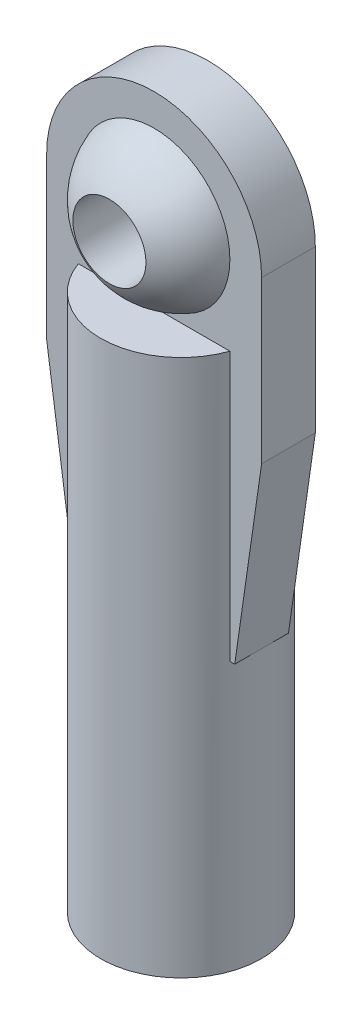
ISO-10303-21;
HEADER;
FILE_DESCRIPTION(('STEP AP214'),'2;1');
FILE_NAME('part.step','',(''),(''),'','','');
FILE_SCHEMA(('AUTOMOTIVE_DESIGN { 1 0 10303 214 1 1 1 1 }'));
ENDSEC;
DATA;
#1=APPLICATION_CONTEXT('core data for automotive mechanical design processes');
#2=APPLICATION_PROTOCOL_DEFINITION('international standard','automotive_design',2000,#1);
#3=PRODUCT_CONTEXT('',#1,'mechanical');
#4=PRODUCT('Part','Part','',(#3));
#5=PRODUCT_RELATED_PRODUCT_CATEGORY('part','',(#4));
#6=PRODUCT_DEFINITION_FORMATION('','',#4);
#7=PRODUCT_DEFINITION_CONTEXT('part definition',#1,'design');
#8=PRODUCT_DEFINITION('design','',#6,#7);
#9=PRODUCT_DEFINITION_SHAPE('','',#8);
#10=(LENGTH_UNIT() NAMED_UNIT(*) SI_UNIT(.MILLI.,.METRE.));
#11=(NAMED_UNIT(*) PLANE_ANGLE_UNIT() SI_UNIT($,.RADIAN.));
#12=(NAMED_UNIT(*) SI_UNIT($,.STERADIAN.) SOLID_ANGLE_UNIT());
#13=UNCERTAINTY_MEASURE_WITH_UNIT(LENGTH_MEASURE(1.E-05),#10,'distance_accuracy_value','');
#14=(GEOMETRIC_REPRESENTATION_CONTEXT(3) GLOBAL_UNCERTAINTY_ASSIGNED_CONTEXT((#13)) GLOBAL_UNIT_ASSIGNED_CONTEXT((#10,
#11,#12)) REPRESENTATION_CONTEXT('',''));
#15=CARTESIAN_POINT('',(0.,0.,0.));
#16=DIRECTION('',(0.,0.,1.));
#17=DIRECTION('',(1.,0.,0.));
#18=AXIS2_PLACEMENT_3D('',#15,#16,#17);
#19=CARTESIAN_POINT('',(-2.38125,-10.287,0.79375));
#20=DIRECTION('',(0.,1.,0.));
#21=DIRECTION('',(0.,0.,1.));
#22=AXIS2_PLACEMENT_3D('',#19,#20,#21);
#23=PLANE('',#22);
#24=DIRECTION('',(1.,0.,0.));
#25=VECTOR('',#24,1.);
#26=CARTESIAN_POINT('',(-2.38125,-10.287,0.79375));
#27=LINE('',#26,#25);
#28=CARTESIAN_POINT('',(2.23832771226646,-10.287,0.79375));
#29=VERTEX_POINT('',#28);
#30=CARTESIAN_POINT('',(2.38125,-10.287,0.79375));
#31=VERTEX_POINT('',#30);
#32=EDGE_CURVE('E92',#29,#31,#27,.T.);
#33=ORIENTED_EDGE('',*,*,#32,.F.);
#34=CARTESIAN_POINT('',(0.,-10.287,0.));
#35=DIRECTION('',(0.,1.,0.));
#36=DIRECTION('',(0.,0.,1.));
#37=AXIS2_PLACEMENT_3D('',#34,#35,#36);
#38=CIRCLE('',#37,2.3749);
#39=CARTESIAN_POINT('',(2.23832771226646,-10.287,-0.79375));
#40=VERTEX_POINT('',#39);
#41=EDGE_CURVE('E41',#29,#40,#38,.T.);
#42=ORIENTED_EDGE('',*,*,#41,.T.);
#43=DIRECTION('',(1.,0.,0.));
#44=VECTOR('',#43,1.);
#45=CARTESIAN_POINT('',(-2.38125,-10.287,-0.79375));
#46=LINE('',#45,#44);
#47=CARTESIAN_POINT('',(2.38125,-10.287,-0.79375));
#48=VERTEX_POINT('',#47);
#49=EDGE_CURVE('E135',#40,#48,#46,.T.);
#50=ORIENTED_EDGE('',*,*,#49,.T.);
#51=DIRECTION('',(0.,0.,-1.));
#52=VECTOR('',#51,1.);
#53=CARTESIAN_POINT('',(2.38125,-10.287,0.79375));
#54=LINE('',#53,#52);
#55=EDGE_CURVE('E149',#31,#48,#54,.T.);
#56=ORIENTED_EDGE('',*,*,#55,.F.);
#57=EDGE_LOOP('',(#33,#42,#50,#56));
#58=FACE_BOUND('',#57,.T.);
#59=ADVANCED_FACE('F33',(#58),#23,.F.);
#60=CARTESIAN_POINT('',(0.,0.,0.));
#61=DIRECTION('',(0.,1.,0.));
#62=DIRECTION('',(1.,0.,0.));
#63=AXIS2_PLACEMENT_3D('',#60,#61,#62);
#64=SPHERICAL_SURFACE('',#63,2.3749);
#65=CARTESIAN_POINT('',(0.,0.,0.));
#66=DIRECTION('',(0.,0.,1.));
#67=DIRECTION('',(1.,0.,0.));
#68=AXIS2_PLACEMENT_3D('',#65,#66,#67);
#69=SPHERICAL_SURFACE('',#68,2.3749);
#70=CARTESIAN_POINT('',(0.,0.,-2.11537934186755));
#71=DIRECTION('',(0.,0.,1.));
#72=DIRECTION('',(1.,0.,0.));
#73=AXIS2_PLACEMENT_3D('',#70,#71,#72);
#74=CIRCLE('',#73,1.0795);
#75=CARTESIAN_POINT('',(1.0795,0.,-2.11537934186755));
#76=VERTEX_POINT('',#75);
#77=EDGE_CURVE('E160',#76,#76,#74,.T.);
#78=ORIENTED_EDGE('',*,*,#77,.T.);
#79=EDGE_LOOP('',(#78));
#80=FACE_BOUND('',#79,.T.);
#81=CARTESIAN_POINT('',(0.,0.,-0.79375));
#82=DIRECTION('',(0.,0.,1.));
#83=DIRECTION('',(1.,0.,0.));
#84=AXIS2_PLACEMENT_3D('',#81,#82,#83);
#85=CIRCLE('',#84,2.23832771226646);
#86=CARTESIAN_POINT('',(2.23832771226646,0.,-0.79375));
#87=VERTEX_POINT('',#86);
#88=EDGE_CURVE('E153',#87,#87,#85,.T.);
#89=ORIENTED_EDGE('',*,*,#88,.F.);
#90=EDGE_LOOP('',(#89));
#91=FACE_BOUND('',#90,.T.);
#92=ADVANCED_FACE('F248',(#80,#91),#69,.T.);
#93=CARTESIAN_POINT('',(0.,0.,0.));
#94=DIRECTION('',(0.,0.,1.));
#95=DIRECTION('',(1.,0.,0.));
#96=AXIS2_PLACEMENT_3D('',#93,#94,#95);
#97=SPHERICAL_SURFACE('',#96,2.3749);
#98=CARTESIAN_POINT('',(0.,0.,0.79375));
#99=DIRECTION('',(0.,0.,1.));
#100=DIRECTION('',(1.,0.,0.));
#101=AXIS2_PLACEMENT_3D('',#98,#99,#100);
#102=CIRCLE('',#101,2.23832771226646);
#103=CARTESIAN_POINT('',(2.23832771226646,0.,0.79375));
#104=VERTEX_POINT('',#103);
#105=EDGE_CURVE('E152',#104,#104,#102,.T.);
#106=ORIENTED_EDGE('',*,*,#105,.T.);
#107=EDGE_LOOP('',(#106));
#108=FACE_BOUND('',#107,.T.);
#109=CARTESIAN_POINT('',(0.,0.,2.11537934186755));
#110=DIRECTION('',(0.,0.,-1.));
#111=DIRECTION('',(-1.,0.,0.));
#112=AXIS2_PLACEMENT_3D('',#109,#110,#111);
#113=CIRCLE('',#112,1.0795);
#114=CARTESIAN_POINT('',(-1.0795,0.,2.11537934186755));
#115=VERTEX_POINT('',#114);
#116=EDGE_CURVE('E157',#115,#115,#113,.T.);
#117=ORIENTED_EDGE('',*,*,#116,.T.);
#118=EDGE_LOOP('',(#117));
#119=FACE_BOUND('',#118,.T.);
#120=ADVANCED_FACE('F35',(#108,#119),#97,.T.);
#121=CARTESIAN_POINT('',(0.,0.,-2.3749));
#122=DIRECTION('',(0.,0.,1.));
#123=DIRECTION('',(1.,0.,0.));
#124=AXIS2_PLACEMENT_3D('',#121,#122,#123);
#125=CYLINDRICAL_SURFACE('',#124,1.0795);
#126=ORIENTED_EDGE('',*,*,#116,.F.);
#127=EDGE_LOOP('',(#126));
#128=FACE_BOUND('',#127,.T.);
#129=ORIENTED_EDGE('',*,*,#77,.F.);
#130=EDGE_LOOP('',(#129));
#131=FACE_BOUND('',#130,.T.);
#132=ADVANCED_FACE('F264',(#128,#131),#125,.F.);
#133=CARTESIAN_POINT('',(0.,0.,0.79375));
#134=DIRECTION('',(0.,0.,1.));
#135=DIRECTION('',(1.,0.,0.));
#136=AXIS2_PLACEMENT_3D('',#133,#134,#135);
#137=PLANE('',#136);
#138=DIRECTION('',(0.,-1.,0.));
#139=VECTOR('',#138,1.);
#140=CARTESIAN_POINT('',(-2.23832771226646,-2.3495,0.79375));
#141=LINE('',#140,#139);
#142=CARTESIAN_POINT('',(-2.23832771226646,-2.3495,0.79375));
#143=VERTEX_POINT('',#142);
#144=CARTESIAN_POINT('',(-2.23832771226646,-10.287,0.79375));
#145=VERTEX_POINT('',#144);
#146=EDGE_CURVE('E48',#143,#145,#141,.T.);
#147=ORIENTED_EDGE('',*,*,#146,.F.);
#148=DIRECTION('',(1.,0.,0.));
#149=VECTOR('',#148,1.);
#150=CARTESIAN_POINT('',(0.,-2.3495,0.79375));
#151=LINE('',#150,#149);
#152=CARTESIAN_POINT('',(2.23832771226646,-2.3495,0.79375));
#153=VERTEX_POINT('',#152);
#154=EDGE_CURVE('E183',#143,#153,#151,.T.);
#155=ORIENTED_EDGE('',*,*,#154,.T.);
#156=DIRECTION('',(0.,-1.,0.));
#157=VECTOR('',#156,1.);
#158=CARTESIAN_POINT('',(2.23832771226646,-2.3495,0.79375));
#159=LINE('',#158,#157);
#160=EDGE_CURVE('E185',#29,#153,#159,.F.);
#161=ORIENTED_EDGE('',*,*,#160,.F.);
#162=ORIENTED_EDGE('',*,*,#32,.T.);
#163=DIRECTION('',(0.142217729757998,0.989835399115672,0.));
#164=VECTOR('',#163,1.);
#165=CARTESIAN_POINT('',(3.175,-4.7625,0.79375));
#166=LINE('',#165,#164);
#167=CARTESIAN_POINT('',(3.175,-4.7625,0.79375));
#168=VERTEX_POINT('',#167);
#169=EDGE_CURVE('E194',#31,#168,#166,.T.);
#170=ORIENTED_EDGE('',*,*,#169,.T.);
#171=DIRECTION('',(0.,1.,0.));
#172=VECTOR('',#171,1.);
#173=CARTESIAN_POINT('',(3.175,0.,0.79375));
#174=LINE('',#173,#172);
#175=CARTESIAN_POINT('',(3.175,0.,0.79375));
#176=VERTEX_POINT('',#175);
#177=EDGE_CURVE('E110',#168,#176,#174,.T.);
#178=ORIENTED_EDGE('',*,*,#177,.T.);
#179=CARTESIAN_POINT('',(0.,0.,0.79375));
#180=DIRECTION('',(0.,0.,1.));
#181=DIRECTION('',(1.,0.,0.));
#182=AXIS2_PLACEMENT_3D('',#179,#180,#181);
#183=CIRCLE('',#182,3.175);
#184=CARTESIAN_POINT('',(-3.175,0.,0.79375));
#185=VERTEX_POINT('',#184);
#186=EDGE_CURVE('E102',#176,#185,#183,.T.);
#187=ORIENTED_EDGE('',*,*,#186,.T.);
#188=DIRECTION('',(0.,-1.,0.));
#189=VECTOR('',#188,1.);
#190=CARTESIAN_POINT('',(-3.175,0.,0.79375));
#191=LINE('',#190,#189);
#192=CARTESIAN_POINT('',(-3.175,-4.7625,0.79375));
#193=VERTEX_POINT('',#192);
#194=EDGE_CURVE('E107',#185,#193,#191,.T.);
#195=ORIENTED_EDGE('',*,*,#194,.T.);
#196=DIRECTION('',(0.142217729757999,-0.989835399115672,0.));
#197=VECTOR('',#196,1.);
#198=CARTESIAN_POINT('',(-3.175,-4.7625,0.79375));
#199=LINE('',#198,#197);
#200=CARTESIAN_POINT('',(-2.38125,-10.287,0.79375));
#201=VERTEX_POINT('',#200);
#202=EDGE_CURVE('E57',#193,#201,#199,.T.);
#203=ORIENTED_EDGE('',*,*,#202,.T.);
#204=EDGE_CURVE('E192',#201,#145,#27,.T.);
#205=ORIENTED_EDGE('',*,*,#204,.T.);
#206=EDGE_LOOP('',(#147,#155,#161,#162,#170,#178,#187,#195,#203,#205));
#207=FACE_BOUND('',#206,.T.);
#208=ORIENTED_EDGE('',*,*,#105,.F.);
#209=EDGE_LOOP('',(#208));
#210=FACE_BOUND('',#209,.T.);
#211=ADVANCED_FACE('F104',(#207,#210),#137,.T.);
#212=CARTESIAN_POINT('',(0.,0.,-0.79375));
#213=DIRECTION('',(0.,0.,1.));
#214=DIRECTION('',(1.,0.,0.));
#215=AXIS2_PLACEMENT_3D('',#212,#213,#214);
#216=PLANE('',#215);
#217=DIRECTION('',(1.,0.,0.));
#218=VECTOR('',#217,1.);
#219=CARTESIAN_POINT('',(0.,-2.3495,-0.79375));
#220=LINE('',#219,#218);
#221=CARTESIAN_POINT('',(-2.23832771226646,-2.3495,-0.79375));
#222=VERTEX_POINT('',#221);
#223=CARTESIAN_POINT('',(2.23832771226646,-2.3495,-0.79375));
#224=VERTEX_POINT('',#223);
#225=EDGE_CURVE('E11',#222,#224,#220,.T.);
#226=ORIENTED_EDGE('',*,*,#225,.F.);
#227=DIRECTION('',(0.,-1.,0.));
#228=VECTOR('',#227,1.);
#229=CARTESIAN_POINT('',(-2.23832771226646,-2.3495,-0.79375));
#230=LINE('',#229,#228);
#231=CARTESIAN_POINT('',(-2.23832771226646,-10.287,-0.79375));
#232=VERTEX_POINT('',#231);
#233=EDGE_CURVE('E206',#222,#232,#230,.T.);
#234=ORIENTED_EDGE('',*,*,#233,.T.);
#235=CARTESIAN_POINT('',(-2.38125,-10.287,-0.79375));
#236=VERTEX_POINT('',#235);
#237=EDGE_CURVE('E131',#236,#232,#46,.T.);
#238=ORIENTED_EDGE('',*,*,#237,.F.);
#239=DIRECTION('',(0.142217729757999,-0.989835399115672,0.));
#240=VECTOR('',#239,1.);
#241=CARTESIAN_POINT('',(-3.175,-4.7625,-0.79375));
#242=LINE('',#241,#240);
#243=CARTESIAN_POINT('',(-3.175,-4.7625,-0.79375));
#244=VERTEX_POINT('',#243);
#245=EDGE_CURVE('E84',#244,#236,#242,.T.);
#246=ORIENTED_EDGE('',*,*,#245,.F.);
#247=DIRECTION('',(0.,-1.,0.));
#248=VECTOR('',#247,1.);
#249=CARTESIAN_POINT('',(-3.175,0.,-0.79375));
#250=LINE('',#249,#248);
#251=CARTESIAN_POINT('',(-3.175,0.,-0.79375));
#252=VERTEX_POINT('',#251);
#253=EDGE_CURVE('E140',#252,#244,#250,.T.);
#254=ORIENTED_EDGE('',*,*,#253,.F.);
#255=CARTESIAN_POINT('',(0.,0.,-0.79375));
#256=DIRECTION('',(0.,0.,1.));
#257=DIRECTION('',(1.,0.,0.));
#258=AXIS2_PLACEMENT_3D('',#255,#256,#257);
#259=CIRCLE('',#258,3.175);
#260=CARTESIAN_POINT('',(3.175,0.,-0.79375));
#261=VERTEX_POINT('',#260);
#262=EDGE_CURVE('E119',#261,#252,#259,.T.);
#263=ORIENTED_EDGE('',*,*,#262,.F.);
#264=DIRECTION('',(0.,1.,0.));
#265=VECTOR('',#264,1.);
#266=CARTESIAN_POINT('',(3.175,0.,-0.79375));
#267=LINE('',#266,#265);
#268=CARTESIAN_POINT('',(3.175,-4.7625,-0.79375));
#269=VERTEX_POINT('',#268);
#270=EDGE_CURVE('E137',#269,#261,#267,.T.);
#271=ORIENTED_EDGE('',*,*,#270,.F.);
#272=DIRECTION('',(0.142217729757998,0.989835399115672,0.));
#273=VECTOR('',#272,1.);
#274=CARTESIAN_POINT('',(3.175,-4.7625,-0.79375));
#275=LINE('',#274,#273);
#276=EDGE_CURVE('E134',#48,#269,#275,.T.);
#277=ORIENTED_EDGE('',*,*,#276,.F.);
#278=ORIENTED_EDGE('',*,*,#49,.F.);
#279=DIRECTION('',(0.,-1.,0.));
#280=VECTOR('',#279,1.);
#281=CARTESIAN_POINT('',(2.23832771226646,-2.3495,-0.79375));
#282=LINE('',#281,#280);
#283=EDGE_CURVE('E181',#40,#224,#282,.F.);
#284=ORIENTED_EDGE('',*,*,#283,.T.);
#285=EDGE_LOOP('',(#226,#234,#238,#246,#254,#263,#271,#277,#278,#284));
#286=FACE_BOUND('',#285,.T.);
#287=ORIENTED_EDGE('',*,*,#88,.T.);
#288=EDGE_LOOP('',(#287));
#289=FACE_BOUND('',#288,.T.);
#290=ADVANCED_FACE('F178',(#286,#289),#216,.F.);
#291=ORIENTED_EDGE('',*,*,#237,.T.);
#292=EDGE_CURVE('E156',#232,#145,#38,.T.);
#293=ORIENTED_EDGE('',*,*,#292,.T.);
#294=ORIENTED_EDGE('',*,*,#204,.F.);
#295=DIRECTION('',(0.,0.,-1.));
#296=VECTOR('',#295,1.);
#297=CARTESIAN_POINT('',(-2.38125,-10.287,0.79375));
#298=LINE('',#297,#296);
#299=EDGE_CURVE('E127',#201,#236,#298,.T.);
#300=ORIENTED_EDGE('',*,*,#299,.T.);
#301=EDGE_LOOP('',(#291,#293,#294,#300));
#302=FACE_BOUND('',#301,.T.);
#303=ADVANCED_FACE('F202',(#302),#23,.F.);
#304=CARTESIAN_POINT('',(3.175,-4.7625,0.79375));
#305=DIRECTION('',(-0.989835399115672,0.142217729757998,0.));
#306=DIRECTION('',(-0.142217729757998,-0.989835399115672,0.));
#307=AXIS2_PLACEMENT_3D('',#304,#305,#306);
#308=PLANE('',#307);
#309=ORIENTED_EDGE('',*,*,#276,.T.);
#310=DIRECTION('',(0.,0.,-1.));
#311=VECTOR('',#310,1.);
#312=CARTESIAN_POINT('',(3.175,-4.7625,0.79375));
#313=LINE('',#312,#311);
#314=EDGE_CURVE('E146',#168,#269,#313,.T.);
#315=ORIENTED_EDGE('',*,*,#314,.F.);
#316=ORIENTED_EDGE('',*,*,#169,.F.);
#317=ORIENTED_EDGE('',*,*,#55,.T.);
#318=EDGE_LOOP('',(#309,#315,#316,#317));
#319=FACE_BOUND('',#318,.T.);
#320=ADVANCED_FACE('F197',(#319),#308,.F.);
#321=CARTESIAN_POINT('',(3.175,0.,0.79375));
#322=DIRECTION('',(-1.,0.,0.));
#323=DIRECTION('',(0.,-1.,0.));
#324=AXIS2_PLACEMENT_3D('',#321,#322,#323);
#325=PLANE('',#324);
#326=ORIENTED_EDGE('',*,*,#270,.T.);
#327=DIRECTION('',(0.,0.,-1.));
#328=VECTOR('',#327,1.);
#329=CARTESIAN_POINT('',(3.175,0.,0.79375));
#330=LINE('',#329,#328);
#331=EDGE_CURVE('E122',#176,#261,#330,.T.);
#332=ORIENTED_EDGE('',*,*,#331,.F.);
#333=ORIENTED_EDGE('',*,*,#177,.F.);
#334=ORIENTED_EDGE('',*,*,#314,.T.);
#335=EDGE_LOOP('',(#326,#332,#333,#334));
#336=FACE_BOUND('',#335,.T.);
#337=ADVANCED_FACE('F199',(#336),#325,.F.);
#338=CARTESIAN_POINT('',(0.,0.,0.79375));
#339=DIRECTION('',(0.,0.,-1.));
#340=DIRECTION('',(-1.,0.,0.));
#341=AXIS2_PLACEMENT_3D('',#338,#339,#340);
#342=CYLINDRICAL_SURFACE('',#341,3.175);
#343=ORIENTED_EDGE('',*,*,#262,.T.);
#344=DIRECTION('',(0.,0.,-1.));
#345=VECTOR('',#344,1.);
#346=CARTESIAN_POINT('',(-3.175,0.,0.79375));
#347=LINE('',#346,#345);
#348=EDGE_CURVE('E116',#185,#252,#347,.T.);
#349=ORIENTED_EDGE('',*,*,#348,.F.);
#350=ORIENTED_EDGE('',*,*,#186,.F.);
#351=ORIENTED_EDGE('',*,*,#331,.T.);
#352=EDGE_LOOP('',(#343,#349,#350,#351));
#353=FACE_BOUND('',#352,.T.);
#354=ADVANCED_FACE('F117',(#353),#342,.T.);
#355=CARTESIAN_POINT('',(-3.175,0.,0.79375));
#356=DIRECTION('',(1.,0.,0.));
#357=DIRECTION('',(0.,1.,0.));
#358=AXIS2_PLACEMENT_3D('',#355,#356,#357);
#359=PLANE('',#358);
#360=ORIENTED_EDGE('',*,*,#253,.T.);
#361=DIRECTION('',(0.,0.,-1.));
#362=VECTOR('',#361,1.);
#363=CARTESIAN_POINT('',(-3.175,-4.7625,0.79375));
#364=LINE('',#363,#362);
#365=EDGE_CURVE('E123',#193,#244,#364,.T.);
#366=ORIENTED_EDGE('',*,*,#365,.F.);
#367=ORIENTED_EDGE('',*,*,#194,.F.);
#368=ORIENTED_EDGE('',*,*,#348,.T.);
#369=EDGE_LOOP('',(#360,#366,#367,#368));
#370=FACE_BOUND('',#369,.T.);
#371=ADVANCED_FACE('F125',(#370),#359,.F.);
#372=CARTESIAN_POINT('',(-3.175,-4.7625,0.79375));
#373=DIRECTION('',(0.989835399115672,0.142217729757999,0.));
#374=DIRECTION('',(-0.142217729757999,0.989835399115672,0.));
#375=AXIS2_PLACEMENT_3D('',#372,#373,#374);
#376=PLANE('',#375);
#377=ORIENTED_EDGE('',*,*,#245,.T.);
#378=ORIENTED_EDGE('',*,*,#299,.F.);
#379=ORIENTED_EDGE('',*,*,#202,.F.);
#380=ORIENTED_EDGE('',*,*,#365,.T.);
#381=EDGE_LOOP('',(#377,#378,#379,#380));
#382=FACE_BOUND('',#381,.T.);
#383=ADVANCED_FACE('F201',(#382),#376,.F.);
#384=CARTESIAN_POINT('',(0.,-2.3495,0.));
#385=DIRECTION('',(0.,-1.,0.));
#386=DIRECTION('',(0.,0.,-1.));
#387=AXIS2_PLACEMENT_3D('',#384,#385,#386);
#388=PLANE('',#387);
#389=CARTESIAN_POINT('',(0.,-2.3495,0.));
#390=DIRECTION('',(0.,-1.,0.));
#391=DIRECTION('',(0.,0.,-1.));
#392=AXIS2_PLACEMENT_3D('',#389,#390,#391);
#393=CIRCLE('',#392,2.3749);
#394=EDGE_CURVE('E215',#222,#224,#393,.T.);
#395=ORIENTED_EDGE('',*,*,#394,.F.);
#396=ORIENTED_EDGE('',*,*,#225,.T.);
#397=EDGE_LOOP('',(#395,#396));
#398=FACE_BOUND('',#397,.T.);
#399=ADVANCED_FACE('F237',(#398),#388,.F.);
#400=CARTESIAN_POINT('',(0.,-2.3495,0.));
#401=DIRECTION('',(0.,-1.,0.));
#402=DIRECTION('',(0.,0.,-1.));
#403=AXIS2_PLACEMENT_3D('',#400,#401,#402);
#404=CYLINDRICAL_SURFACE('',#403,2.3749);
#405=ORIENTED_EDGE('',*,*,#41,.F.);
#406=ORIENTED_EDGE('',*,*,#160,.T.);
#407=EDGE_CURVE('E209',#153,#143,#393,.T.);
#408=ORIENTED_EDGE('',*,*,#407,.T.);
#409=ORIENTED_EDGE('',*,*,#146,.T.);
#410=ORIENTED_EDGE('',*,*,#292,.F.);
#411=ORIENTED_EDGE('',*,*,#233,.F.);
#412=ORIENTED_EDGE('',*,*,#394,.T.);
#413=ORIENTED_EDGE('',*,*,#283,.F.);
#414=EDGE_LOOP('',(#405,#406,#408,#409,#410,#411,#412,#413));
#415=FACE_BOUND('',#414,.T.);
#416=CARTESIAN_POINT('',(0.,-18.2245,0.));
#417=DIRECTION('',(0.,-1.,0.));
#418=DIRECTION('',(0.,0.,-1.));
#419=AXIS2_PLACEMENT_3D('',#416,#417,#418);
#420=CIRCLE('',#419,2.3749);
#421=CARTESIAN_POINT('',(0.,-18.2245,-2.3749));
#422=VERTEX_POINT('',#421);
#423=EDGE_CURVE('E212',#422,#422,#420,.T.);
#424=ORIENTED_EDGE('',*,*,#423,.F.);
#425=EDGE_LOOP('',(#424));
#426=FACE_BOUND('',#425,.T.);
#427=ADVANCED_FACE('F235',(#415,#426),#404,.T.);
#428=ORIENTED_EDGE('',*,*,#154,.F.);
#429=ORIENTED_EDGE('',*,*,#407,.F.);
#430=EDGE_LOOP('',(#428,#429));
#431=FACE_BOUND('',#430,.T.);
#432=ADVANCED_FACE('F231',(#431),#388,.F.);
#433=CARTESIAN_POINT('',(0.,-18.2245,0.));
#434=DIRECTION('',(0.,-1.,0.));
#435=DIRECTION('',(0.,0.,-1.));
#436=AXIS2_PLACEMENT_3D('',#433,#434,#435);
#437=PLANE('',#436);
#438=CARTESIAN_POINT('',(0.,-18.2245,0.));
#439=DIRECTION('',(0.,-1.,0.));
#440=DIRECTION('',(0.,0.,-1.));
#441=AXIS2_PLACEMENT_3D('',#438,#439,#440);
#442=CIRCLE('',#441,1.13029999999999);
#443=CARTESIAN_POINT('',(0.,-18.2245,-1.13029999999999));
#444=VERTEX_POINT('',#443);
#445=EDGE_CURVE('E221',#444,#444,#442,.T.);
#446=ORIENTED_EDGE('',*,*,#445,.F.);
#447=EDGE_LOOP('',(#446));
#448=FACE_BOUND('',#447,.T.);
#449=ORIENTED_EDGE('',*,*,#423,.T.);
#450=EDGE_LOOP('',(#449));
#451=FACE_BOUND('',#450,.T.);
#452=ADVANCED_FACE('F227',(#448,#451),#437,.T.);
#453=CARTESIAN_POINT('',(0.,-5.5245,0.));
#454=DIRECTION('',(0.,-1.,0.));
#455=DIRECTION('',(0.,0.,-1.));
#456=AXIS2_PLACEMENT_3D('',#453,#454,#455);
#457=CONICAL_SURFACE('',#456,1.1303,1.02974425867665);
#458=CARTESIAN_POINT('',(0.,-4.84534724231315,0.));
#459=VERTEX_POINT('',#458);
#460=VERTEX_LOOP('',#459);
#461=FACE_BOUND('',#460,.T.);
#462=CARTESIAN_POINT('',(0.,-5.5245,0.));
#463=DIRECTION('',(0.,-1.,0.));
#464=DIRECTION('',(0.,0.,-1.));
#465=AXIS2_PLACEMENT_3D('',#462,#463,#464);
#466=CIRCLE('',#465,1.1303);
#467=CARTESIAN_POINT('',(0.,-5.5245,-1.1303));
#468=VERTEX_POINT('',#467);
#469=EDGE_CURVE('E216',#468,#468,#466,.T.);
#470=ORIENTED_EDGE('',*,*,#469,.T.);
#471=EDGE_LOOP('',(#470));
#472=FACE_BOUND('',#471,.T.);
#473=ADVANCED_FACE('F230',(#461,#472),#457,.F.);
#474=CARTESIAN_POINT('',(0.,-18.2245,0.));
#475=DIRECTION('',(0.,-1.,0.));
#476=DIRECTION('',(0.,0.,-1.));
#477=AXIS2_PLACEMENT_3D('',#474,#475,#476);
#478=CYLINDRICAL_SURFACE('',#477,1.13029999999999);
#479=ORIENTED_EDGE('',*,*,#469,.F.);
#480=EDGE_LOOP('',(#479));
#481=FACE_BOUND('',#480,.T.);
#482=ORIENTED_EDGE('',*,*,#445,.T.);
#483=EDGE_LOOP('',(#482));
#484=FACE_BOUND('',#483,.T.);
#485=ADVANCED_FACE('F225',(#481,#484),#478,.F.);
#486=CLOSED_SHELL('',(#59,#92,#120,#132,#211,#290,#303,#320,#337,#354,#371,#383,#399,#427,#432,
#452,#473,#485));
#487=MANIFOLD_SOLID_BREP('B2',#486);
#488=ADVANCED_BREP_SHAPE_REPRESENTATION('',(#18,#487),#14);
#489=SHAPE_DEFINITION_REPRESENTATION(#9,#488);
ENDSEC;
END-ISO-10303-21;
